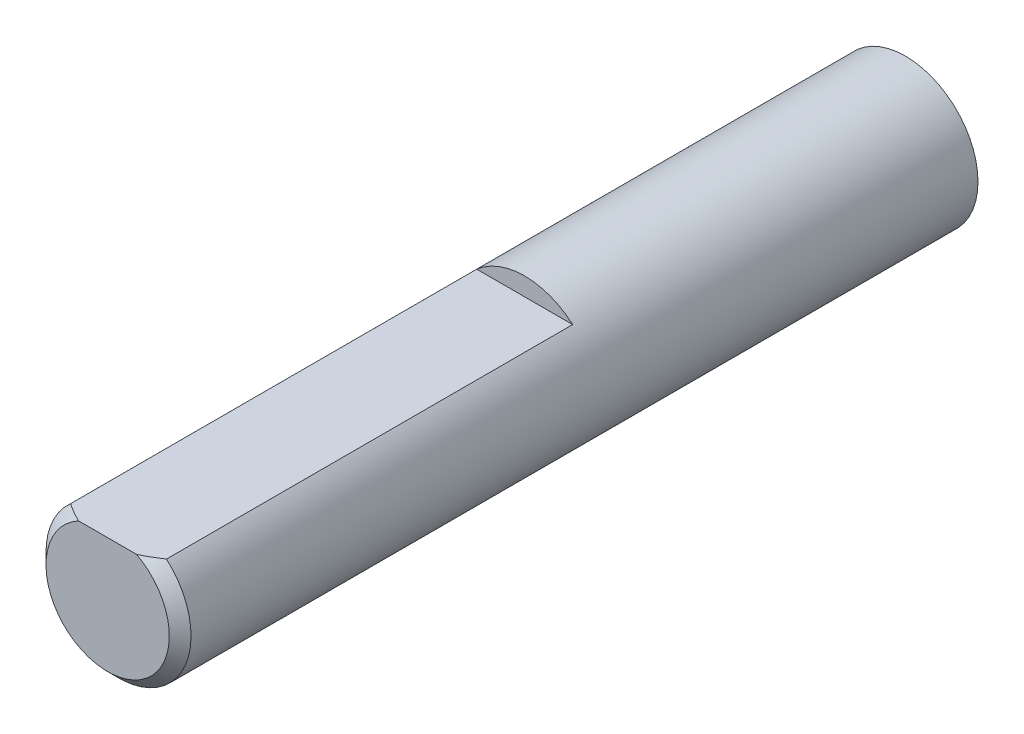
ISO-10303-21;
HEADER;
FILE_DESCRIPTION(('STEP AP214'),'2;1');
FILE_NAME('part.step','',(''),(''),'','','');
FILE_SCHEMA(('AUTOMOTIVE_DESIGN { 1 0 10303 214 1 1 1 1 }'));
ENDSEC;
DATA;
#1=APPLICATION_CONTEXT('core data for automotive mechanical design processes');
#2=APPLICATION_PROTOCOL_DEFINITION('international standard','automotive_design',2000,#1);
#3=PRODUCT_CONTEXT('',#1,'mechanical');
#4=PRODUCT('Part','Part','',(#3));
#5=PRODUCT_RELATED_PRODUCT_CATEGORY('part','',(#4));
#6=PRODUCT_DEFINITION_FORMATION('','',#4);
#7=PRODUCT_DEFINITION_CONTEXT('part definition',#1,'design');
#8=PRODUCT_DEFINITION('design','',#6,#7);
#9=PRODUCT_DEFINITION_SHAPE('','',#8);
#10=(LENGTH_UNIT() NAMED_UNIT(*) SI_UNIT(.MILLI.,.METRE.));
#11=(NAMED_UNIT(*) PLANE_ANGLE_UNIT() SI_UNIT($,.RADIAN.));
#12=(NAMED_UNIT(*) SI_UNIT($,.STERADIAN.) SOLID_ANGLE_UNIT());
#13=UNCERTAINTY_MEASURE_WITH_UNIT(LENGTH_MEASURE(1.E-05),#10,'distance_accuracy_value','');
#14=(GEOMETRIC_REPRESENTATION_CONTEXT(3) GLOBAL_UNCERTAINTY_ASSIGNED_CONTEXT((#13)) GLOBAL_UNIT_ASSIGNED_CONTEXT((#10,
#11,#12)) REPRESENTATION_CONTEXT('',''));
#15=CARTESIAN_POINT('',(0.,0.,0.));
#16=DIRECTION('',(0.,0.,1.));
#17=DIRECTION('',(1.,0.,0.));
#18=AXIS2_PLACEMENT_3D('',#15,#16,#17);
#19=CARTESIAN_POINT('',(0.,0.,12.));
#20=DIRECTION('',(0.,0.,-1.));
#21=DIRECTION('',(-1.,0.,0.));
#22=AXIS2_PLACEMENT_3D('',#19,#20,#21);
#23=CYLINDRICAL_SURFACE('',#22,2.);
#24=CARTESIAN_POINT('',(0.,0.,11.7));
#25=DIRECTION('',(0.,0.,1.));
#26=DIRECTION('',(1.,0.,0.));
#27=AXIS2_PLACEMENT_3D('',#24,#25,#26);
#28=CIRCLE('',#27,2.);
#29=CARTESIAN_POINT('',(1.3228756555323,1.5,11.7));
#30=VERTEX_POINT('',#29);
#31=CARTESIAN_POINT('',(-1.3228756555323,1.5,11.7));
#32=VERTEX_POINT('',#31);
#33=EDGE_CURVE('E82',#30,#32,#28,.F.);
#34=ORIENTED_EDGE('',*,*,#33,.T.);
#35=DIRECTION('',(0.,0.,1.));
#36=VECTOR('',#35,1.);
#37=CARTESIAN_POINT('',(-1.3228756555323,1.5,0.5));
#38=LINE('',#37,#36);
#39=CARTESIAN_POINT('',(-1.3228756555323,1.5,0.5));
#40=VERTEX_POINT('',#39);
#41=EDGE_CURVE('E75',#40,#32,#38,.T.);
#42=ORIENTED_EDGE('',*,*,#41,.F.);
#43=CARTESIAN_POINT('',(0.,0.,0.5));
#44=DIRECTION('',(0.,0.,1.));
#45=DIRECTION('',(1.,0.,0.));
#46=AXIS2_PLACEMENT_3D('',#43,#44,#45);
#47=CIRCLE('',#46,2.);
#48=CARTESIAN_POINT('',(1.3228756555323,1.5,0.5));
#49=VERTEX_POINT('',#48);
#50=EDGE_CURVE('E11',#49,#40,#47,.T.);
#51=ORIENTED_EDGE('',*,*,#50,.F.);
#52=DIRECTION('',(0.,0.,1.));
#53=VECTOR('',#52,1.);
#54=CARTESIAN_POINT('',(1.3228756555323,1.5,0.5));
#55=LINE('',#54,#53);
#56=EDGE_CURVE('E77',#49,#30,#55,.T.);
#57=ORIENTED_EDGE('',*,*,#56,.T.);
#58=EDGE_LOOP('',(#34,#42,#51,#57));
#59=FACE_BOUND('',#58,.T.);
#60=CARTESIAN_POINT('',(0.,0.,-10.));
#61=DIRECTION('',(0.,0.,1.));
#62=DIRECTION('',(1.,0.,0.));
#63=AXIS2_PLACEMENT_3D('',#60,#61,#62);
#64=CIRCLE('',#63,2.);
#65=CARTESIAN_POINT('',(2.,0.,-10.));
#66=VERTEX_POINT('',#65);
#67=EDGE_CURVE('E84',#66,#66,#64,.T.);
#68=ORIENTED_EDGE('',*,*,#67,.T.);
#69=EDGE_LOOP('',(#68));
#70=FACE_BOUND('',#69,.T.);
#71=ADVANCED_FACE('F36',(#59,#70),#23,.T.);
#72=CARTESIAN_POINT('',(0.,0.,12.));
#73=DIRECTION('',(0.,0.,1.));
#74=DIRECTION('',(1.,0.,0.));
#75=AXIS2_PLACEMENT_3D('',#72,#73,#74);
#76=PLANE('',#75);
#77=DIRECTION('',(1.,0.,0.));
#78=VECTOR('',#77,1.);
#79=CARTESIAN_POINT('',(-1.3228756555323,1.5,12.));
#80=LINE('',#79,#78);
#81=CARTESIAN_POINT('',(-0.800000000000007,1.5,12.));
#82=VERTEX_POINT('',#81);
#83=CARTESIAN_POINT('',(0.800000000000007,1.5,12.));
#84=VERTEX_POINT('',#83);
#85=EDGE_CURVE('E52',#82,#84,#80,.T.);
#86=ORIENTED_EDGE('',*,*,#85,.F.);
#87=CARTESIAN_POINT('',(0.,0.,12.));
#88=DIRECTION('',(0.,0.,1.));
#89=DIRECTION('',(1.,0.,0.));
#90=AXIS2_PLACEMENT_3D('',#87,#88,#89);
#91=CIRCLE('',#90,1.7);
#92=EDGE_CURVE('E90',#82,#84,#91,.T.);
#93=ORIENTED_EDGE('',*,*,#92,.T.);
#94=EDGE_LOOP('',(#86,#93));
#95=FACE_BOUND('',#94,.T.);
#96=ADVANCED_FACE('F105',(#95),#76,.T.);
#97=CARTESIAN_POINT('',(0.,0.,-10.));
#98=DIRECTION('',(0.,0.,1.));
#99=DIRECTION('',(1.,0.,0.));
#100=AXIS2_PLACEMENT_3D('',#97,#98,#99);
#101=PLANE('',#100);
#102=ORIENTED_EDGE('',*,*,#67,.F.);
#103=EDGE_LOOP('',(#102));
#104=FACE_BOUND('',#103,.T.);
#105=ADVANCED_FACE('F102',(#104),#101,.F.);
#106=CARTESIAN_POINT('',(0.,0.,12.));
#107=DIRECTION('',(0.,0.,-1.));
#108=DIRECTION('',(-1.,0.,0.));
#109=AXIS2_PLACEMENT_3D('',#106,#107,#108);
#110=CONICAL_SURFACE('',#109,1.7,0.785398163397448);
#111=CARTESIAN_POINT('',(-2.92069889021562,1.5,10.4166355658705));
#112=CARTESIAN_POINT('',(-2.83545622903391,1.5,10.4924366835384));
#113=CARTESIAN_POINT('',(-2.74989103369987,1.5,10.5678815727815));
#114=CARTESIAN_POINT('',(-2.57785770577557,1.5,10.7177986305937));
#115=CARTESIAN_POINT('',(-2.49138924958118,1.5,10.792270427419));
#116=CARTESIAN_POINT('',(-2.31619639656867,1.5,10.9409068676225));
#117=CARTESIAN_POINT('',(-2.22745729155692,1.5,11.0150542315754));
#118=CARTESIAN_POINT('',(-2.04852108736006,1.5,11.1615377722185));
#119=CARTESIAN_POINT('',(-1.95832429341864,1.5,11.2338743202143));
#120=CARTESIAN_POINT('',(-1.78036962411833,1.5,11.372606631561));
#121=CARTESIAN_POINT('',(-1.69270439517325,1.5,11.4391205770972));
#122=CARTESIAN_POINT('',(-1.51501234448669,1.5,11.5689041638871));
#123=CARTESIAN_POINT('',(-1.42498600960659,1.5,11.632174466154));
#124=CARTESIAN_POINT('',(-1.24197624770101,1.5,11.7537642876007));
#125=CARTESIAN_POINT('',(-1.14900206692795,1.5,11.8120975179581));
#126=CARTESIAN_POINT('',(-0.958898623903972,1.5,11.921399327698));
#127=CARTESIAN_POINT('',(-0.86177500572757,1.5,11.9723775224684));
#128=CARTESIAN_POINT('',(-0.669198558635833,1.5,12.0595618310257));
#129=CARTESIAN_POINT('',(-0.574124973204488,1.5,12.0965648697086));
#130=CARTESIAN_POINT('',(-0.428299591874151,1.5,12.14073411696));
#131=CARTESIAN_POINT('',(-0.37926375250984,1.5,12.1535525601386));
#132=CARTESIAN_POINT('',(-0.280263806587031,1.5,12.1748067387399));
#133=CARTESIAN_POINT('',(-0.230300298873952,1.5,12.1832452062463));
#134=CARTESIAN_POINT('',(-0.129050821046568,1.5,12.1953093139826));
#135=CARTESIAN_POINT('',(-0.0777561750938085,1.5,12.1988635955704));
#136=CARTESIAN_POINT('',(0.0249250254957239,1.5,12.2006712521056));
#137=CARTESIAN_POINT('',(0.0763115740575042,1.5,12.1989249653671));
#138=CARTESIAN_POINT('',(0.178784344184836,1.5,12.1902489193502));
#139=CARTESIAN_POINT('',(0.229869290875814,1.5,12.1833043877978));
#140=CARTESIAN_POINT('',(0.331165214313079,1.5,12.1646864848097));
#141=CARTESIAN_POINT('',(0.381375948345254,1.5,12.1530118212784));
#142=CARTESIAN_POINT('',(0.498038250640886,1.5,12.120794083052));
#143=CARTESIAN_POINT('',(0.564024273954548,1.5,12.0985772467779));
#144=CARTESIAN_POINT('',(0.693768927573892,1.5,12.0484174160227));
#145=CARTESIAN_POINT('',(0.757526150725919,1.5,12.0204708778771));
#146=CARTESIAN_POINT('',(0.883577390844449,1.5,11.9599939874842));
#147=CARTESIAN_POINT('',(0.945850686543874,1.5,11.9274210142167));
#148=CARTESIAN_POINT('',(1.06853937891925,1.5,11.8590257030465));
#149=CARTESIAN_POINT('',(1.12895534320627,1.5,11.8232043713482));
#150=CARTESIAN_POINT('',(1.26918447562057,1.5,11.7361185760809));
#151=CARTESIAN_POINT('',(1.34836732536981,1.5,11.6838448706061));
#152=CARTESIAN_POINT('',(1.50459568016017,1.5,11.5761795363514));
#153=CARTESIAN_POINT('',(1.58164049204335,1.5,11.5207869136391));
#154=CARTESIAN_POINT('',(1.73418052533949,1.5,11.4076731926389));
#155=CARTESIAN_POINT('',(1.80967312883435,1.5,11.3499485810116));
#156=CARTESIAN_POINT('',(1.95935651326167,1.5,11.2328339189889));
#157=CARTESIAN_POINT('',(2.03354721797469,1.5,11.1734437716103));
#158=CARTESIAN_POINT('',(2.17656398947588,1.5,11.0569305391019));
#159=CARTESIAN_POINT('',(2.24544895319606,1.5,10.9998795361239));
#160=CARTESIAN_POINT('',(2.38248058569636,1.5,10.8848931959665));
#161=CARTESIAN_POINT('',(2.45062722249331,1.5,10.8269578207372));
#162=CARTESIAN_POINT('',(2.58604798474711,1.5,10.7106111863081));
#163=CARTESIAN_POINT('',(2.6533244841412,1.5,10.6522026852015));
#164=CARTESIAN_POINT('',(2.78736771207713,1.5,10.534816422412));
#165=CARTESIAN_POINT('',(2.8541344896967,1.5,10.4758387168042));
#166=CARTESIAN_POINT('',(2.92069889021562,1.5,10.4166355658705));
#167=B_SPLINE_CURVE_WITH_KNOTS('',3,(#111,#112,#113,#114,#115,#116,#117,#118,#119,#120,#121,
#122,#123,#124,#125,#126,#127,#128,#129,#130,#131,#132,#133,#134,#135,#136,#137,#138,#139,#140,
#141,#142,#143,#144,#145,#146,#147,#148,#149,#150,#151,#152,#153,#154,#155,#156,#157,#158,#159,
#160,#161,#162,#163,#164,#165,#166),.UNSPECIFIED.,.F.,.F.,(4,2,2,2,2,2,2,2,2,2,2,2,2,2,2,2,2,2,
2,2,2,2,2,2,2,2,2,4),(0.,0.342217510910356,0.68456214420005,1.03146309744955,1.37829232656224,
1.70836821240722,2.03837656338681,2.36743609395612,2.69606146270531,3.00113143887684,
3.15301709140184,3.30480788848702,3.45879360292444,3.61276948927742,3.76718461052517,
3.92164194069231,4.13015134568631,4.33879009919448,4.54949335665899,4.76013156863763,
5.04466194256059,5.32928350915443,5.61435116151221,5.89943544779885,6.16775390528176,
6.43608393980229,6.70336143699674,6.97061286677009),.UNSPECIFIED.);
#168=EDGE_CURVE('E45',#32,#82,#167,.T.);
#169=ORIENTED_EDGE('',*,*,#168,.F.);
#170=ORIENTED_EDGE('',*,*,#33,.F.);
#171=EDGE_CURVE('E56',#84,#30,#167,.T.);
#172=ORIENTED_EDGE('',*,*,#171,.F.);
#173=ORIENTED_EDGE('',*,*,#92,.F.);
#174=EDGE_LOOP('',(#169,#170,#172,#173));
#175=FACE_BOUND('',#174,.T.);
#176=ADVANCED_FACE('F38',(#175),#110,.T.);
#177=CARTESIAN_POINT('',(0.,0.,0.5));
#178=DIRECTION('',(0.,0.,1.));
#179=DIRECTION('',(1.,0.,0.));
#180=AXIS2_PLACEMENT_3D('',#177,#178,#179);
#181=PLANE('',#180);
#182=DIRECTION('',(1.,0.,0.));
#183=VECTOR('',#182,1.);
#184=CARTESIAN_POINT('',(-1.3228756555323,1.5,0.5));
#185=LINE('',#184,#183);
#186=EDGE_CURVE('E71',#40,#49,#185,.T.);
#187=ORIENTED_EDGE('',*,*,#186,.T.);
#188=ORIENTED_EDGE('',*,*,#50,.T.);
#189=EDGE_LOOP('',(#187,#188));
#190=FACE_BOUND('',#189,.T.);
#191=ADVANCED_FACE('F70',(#190),#181,.T.);
#192=CARTESIAN_POINT('',(-1.3228756555323,1.5,0.5));
#193=DIRECTION('',(0.,-1.,0.));
#194=DIRECTION('',(0.,0.,-1.));
#195=AXIS2_PLACEMENT_3D('',#192,#193,#194);
#196=PLANE('',#195);
#197=ORIENTED_EDGE('',*,*,#168,.T.);
#198=ORIENTED_EDGE('',*,*,#85,.T.);
#199=ORIENTED_EDGE('',*,*,#171,.T.);
#200=ORIENTED_EDGE('',*,*,#56,.F.);
#201=ORIENTED_EDGE('',*,*,#186,.F.);
#202=ORIENTED_EDGE('',*,*,#41,.T.);
#203=EDGE_LOOP('',(#197,#198,#199,#200,#201,#202));
#204=FACE_BOUND('',#203,.T.);
#205=ADVANCED_FACE('F74',(#204),#196,.F.);
#206=CLOSED_SHELL('',(#71,#96,#105,#176,#191,#205));
#207=MANIFOLD_SOLID_BREP('B2',#206);
#208=ADVANCED_BREP_SHAPE_REPRESENTATION('',(#18,#207),#14);
#209=SHAPE_DEFINITION_REPRESENTATION(#9,#208);
ENDSEC;
END-ISO-10303-21;
